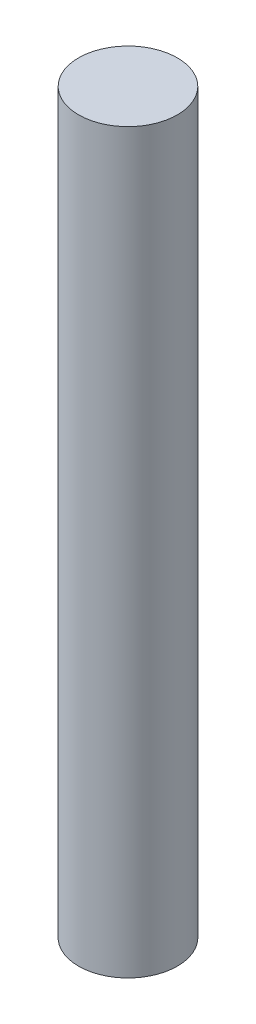
ISO-10303-21;
HEADER;
FILE_DESCRIPTION(('STEP AP214'),'2;1');
FILE_NAME('part.step','',(''),(''),'','','');
FILE_SCHEMA(('AUTOMOTIVE_DESIGN { 1 0 10303 214 1 1 1 1 }'));
ENDSEC;
DATA;
#1=APPLICATION_CONTEXT('core data for automotive mechanical design processes');
#2=APPLICATION_PROTOCOL_DEFINITION('international standard','automotive_design',2000,#1);
#3=PRODUCT_CONTEXT('',#1,'mechanical');
#4=PRODUCT('Part','Part','',(#3));
#5=PRODUCT_RELATED_PRODUCT_CATEGORY('part','',(#4));
#6=PRODUCT_DEFINITION_FORMATION('','',#4);
#7=PRODUCT_DEFINITION_CONTEXT('part definition',#1,'design');
#8=PRODUCT_DEFINITION('design','',#6,#7);
#9=PRODUCT_DEFINITION_SHAPE('','',#8);
#10=(LENGTH_UNIT() NAMED_UNIT(*) SI_UNIT(.MILLI.,.METRE.));
#11=(NAMED_UNIT(*) PLANE_ANGLE_UNIT() SI_UNIT($,.RADIAN.));
#12=(NAMED_UNIT(*) SI_UNIT($,.STERADIAN.) SOLID_ANGLE_UNIT());
#13=UNCERTAINTY_MEASURE_WITH_UNIT(LENGTH_MEASURE(1.E-05),#10,'distance_accuracy_value','');
#14=(GEOMETRIC_REPRESENTATION_CONTEXT(3) GLOBAL_UNCERTAINTY_ASSIGNED_CONTEXT((#13)) GLOBAL_UNIT_ASSIGNED_CONTEXT((#10,
#11,#12)) REPRESENTATION_CONTEXT('',''));
#15=CARTESIAN_POINT('',(0.,0.,0.));
#16=DIRECTION('',(0.,0.,1.));
#17=DIRECTION('',(1.,0.,0.));
#18=AXIS2_PLACEMENT_3D('',#15,#16,#17);
#19=CARTESIAN_POINT('',(0.,70.,0.));
#20=DIRECTION('',(0.,-1.,0.));
#21=DIRECTION('',(0.,0.,-1.));
#22=AXIS2_PLACEMENT_3D('',#19,#20,#21);
#23=CYLINDRICAL_SURFACE('',#22,4.69);
#24=CARTESIAN_POINT('',(0.,70.,0.));
#25=DIRECTION('',(0.,1.,0.));
#26=DIRECTION('',(0.,0.,1.));
#27=AXIS2_PLACEMENT_3D('',#24,#25,#26);
#28=CIRCLE('',#27,4.69);
#29=CARTESIAN_POINT('',(0.,70.,4.69));
#30=VERTEX_POINT('',#29);
#31=EDGE_CURVE('E10',#30,#30,#28,.T.);
#32=ORIENTED_EDGE('',*,*,#31,.F.);
#33=EDGE_LOOP('',(#32));
#34=FACE_BOUND('',#33,.T.);
#35=CARTESIAN_POINT('',(0.,0.,0.));
#36=DIRECTION('',(0.,1.,0.));
#37=DIRECTION('',(0.,0.,1.));
#38=AXIS2_PLACEMENT_3D('',#35,#36,#37);
#39=CIRCLE('',#38,4.69);
#40=CARTESIAN_POINT('',(0.,0.,4.69));
#41=VERTEX_POINT('',#40);
#42=EDGE_CURVE('E36',#41,#41,#39,.T.);
#43=ORIENTED_EDGE('',*,*,#42,.T.);
#44=EDGE_LOOP('',(#43));
#45=FACE_BOUND('',#44,.T.);
#46=ADVANCED_FACE('F33',(#34,#45),#23,.T.);
#47=CARTESIAN_POINT('',(0.,70.,0.));
#48=DIRECTION('',(0.,1.,0.));
#49=DIRECTION('',(0.,0.,1.));
#50=AXIS2_PLACEMENT_3D('',#47,#48,#49);
#51=PLANE('',#50);
#52=ORIENTED_EDGE('',*,*,#31,.T.);
#53=EDGE_LOOP('',(#52));
#54=FACE_BOUND('',#53,.T.);
#55=ADVANCED_FACE('F48',(#54),#51,.T.);
#56=CARTESIAN_POINT('',(0.,0.,0.));
#57=DIRECTION('',(0.,1.,0.));
#58=DIRECTION('',(0.,0.,1.));
#59=AXIS2_PLACEMENT_3D('',#56,#57,#58);
#60=PLANE('',#59);
#61=ORIENTED_EDGE('',*,*,#42,.F.);
#62=EDGE_LOOP('',(#61));
#63=FACE_BOUND('',#62,.T.);
#64=ADVANCED_FACE('F46',(#63),#60,.F.);
#65=CLOSED_SHELL('',(#46,#55,#64));
#66=MANIFOLD_SOLID_BREP('B2',#65);
#67=ADVANCED_BREP_SHAPE_REPRESENTATION('',(#18,#66),#14);
#68=SHAPE_DEFINITION_REPRESENTATION(#9,#67);
ENDSEC;
END-ISO-10303-21;
